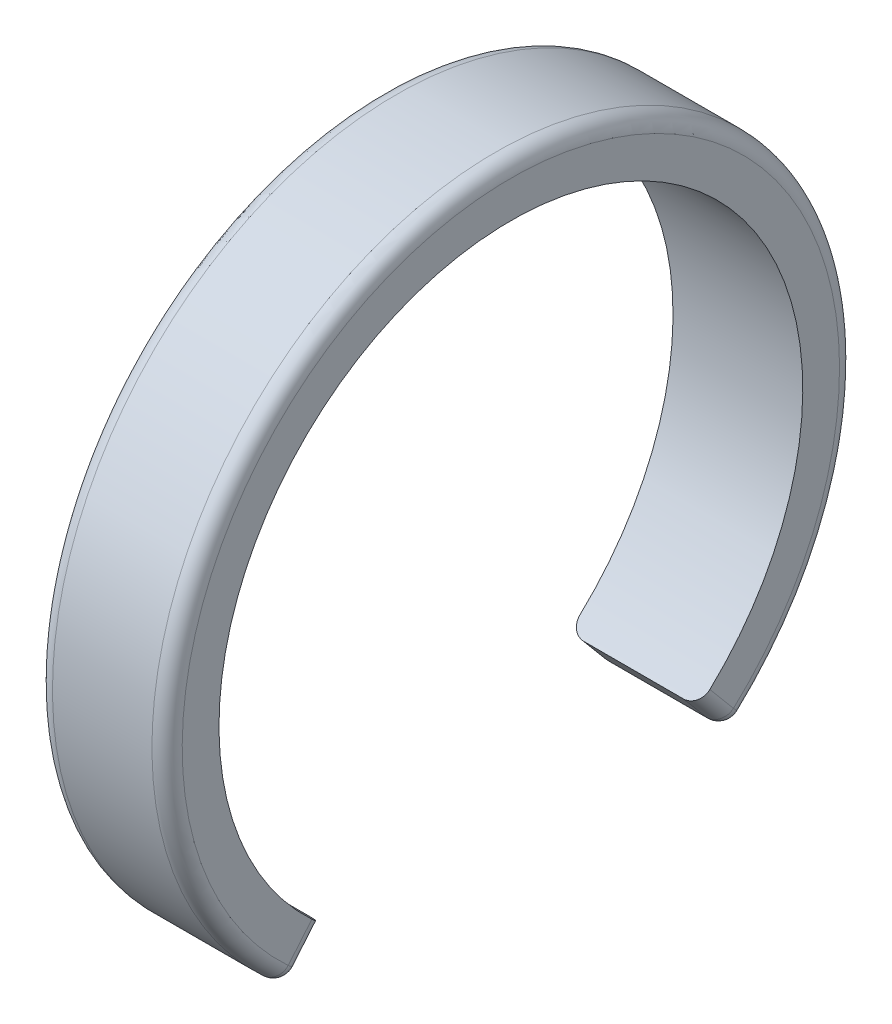
ISO-10303-21;
HEADER;
FILE_DESCRIPTION(('STEP AP214'),'2;1');
FILE_NAME('part.step','',(''),(''),'','','');
FILE_SCHEMA(('AUTOMOTIVE_DESIGN { 1 0 10303 214 1 1 1 1 }'));
ENDSEC;
DATA;
#1=APPLICATION_CONTEXT('core data for automotive mechanical design processes');
#2=APPLICATION_PROTOCOL_DEFINITION('international standard','automotive_design',2000,#1);
#3=PRODUCT_CONTEXT('',#1,'mechanical');
#4=PRODUCT('Part','Part','',(#3));
#5=PRODUCT_RELATED_PRODUCT_CATEGORY('part','',(#4));
#6=PRODUCT_DEFINITION_FORMATION('','',#4);
#7=PRODUCT_DEFINITION_CONTEXT('part definition',#1,'design');
#8=PRODUCT_DEFINITION('design','',#6,#7);
#9=PRODUCT_DEFINITION_SHAPE('','',#8);
#10=(LENGTH_UNIT() NAMED_UNIT(*) SI_UNIT(.MILLI.,.METRE.));
#11=(NAMED_UNIT(*) PLANE_ANGLE_UNIT() SI_UNIT($,.RADIAN.));
#12=(NAMED_UNIT(*) SI_UNIT($,.STERADIAN.) SOLID_ANGLE_UNIT());
#13=UNCERTAINTY_MEASURE_WITH_UNIT(LENGTH_MEASURE(1.E-05),#10,'distance_accuracy_value','');
#14=(GEOMETRIC_REPRESENTATION_CONTEXT(3) GLOBAL_UNCERTAINTY_ASSIGNED_CONTEXT((#13)) GLOBAL_UNIT_ASSIGNED_CONTEXT((#10,
#11,#12)) REPRESENTATION_CONTEXT('',''));
#15=CARTESIAN_POINT('',(0.,0.,0.));
#16=DIRECTION('',(0.,0.,1.));
#17=DIRECTION('',(1.,0.,0.));
#18=AXIS2_PLACEMENT_3D('',#15,#16,#17);
#19=CARTESIAN_POINT('',(2.3,0.,0.));
#20=DIRECTION('',(-1.,0.,0.));
#21=DIRECTION('',(0.,0.,1.));
#22=AXIS2_PLACEMENT_3D('',#19,#20,#21);
#23=TOROIDAL_SURFACE('',#22,15.2,0.699999999999999);
#24=CARTESIAN_POINT('',(2.3,0.,0.));
#25=DIRECTION('',(-1.,0.,0.));
#26=DIRECTION('',(0.,0.,1.));
#27=AXIS2_PLACEMENT_3D('',#24,#25,#26);
#28=CIRCLE('',#27,15.9);
#29=CARTESIAN_POINT('',(2.3,-11.6965109622396,10.770405345678));
#30=VERTEX_POINT('',#29);
#31=CARTESIAN_POINT('',(2.3,-11.6965109622396,-10.770405345678));
#32=VERTEX_POINT('',#31);
#33=EDGE_CURVE('E190',#30,#32,#28,.T.);
#34=ORIENTED_EDGE('',*,*,#33,.F.);
#35=CARTESIAN_POINT('',(2.3,-11.1815702280529,10.2962365568746));
#36=DIRECTION('',(0.,0.677383984004905,0.735629620266641));
#37=DIRECTION('',(0.,-0.735629620266641,0.677383984004905));
#38=AXIS2_PLACEMENT_3D('',#35,#36,#37);
#39=CIRCLE('',#38,0.699999999999999);
#40=CARTESIAN_POINT('',(3.,-11.1815702280529,10.2962365568746));
#41=VERTEX_POINT('',#40);
#42=EDGE_CURVE('E250',#30,#41,#39,.T.);
#43=ORIENTED_EDGE('',*,*,#42,.T.);
#44=CARTESIAN_POINT('',(3.,0.,0.));
#45=DIRECTION('',(-1.,0.,0.));
#46=DIRECTION('',(0.,0.,1.));
#47=AXIS2_PLACEMENT_3D('',#44,#45,#46);
#48=CIRCLE('',#47,15.2);
#49=CARTESIAN_POINT('',(3.,-11.1815702280529,-10.2962365568746));
#50=VERTEX_POINT('',#49);
#51=EDGE_CURVE('E135',#41,#50,#48,.T.);
#52=ORIENTED_EDGE('',*,*,#51,.T.);
#53=CARTESIAN_POINT('',(2.3,-11.1815702280529,-10.2962365568746));
#54=DIRECTION('',(0.,-0.677383984004905,0.735629620266641));
#55=DIRECTION('',(0.,-0.735629620266641,-0.677383984004905));
#56=AXIS2_PLACEMENT_3D('',#53,#54,#55);
#57=CIRCLE('',#56,0.699999999999999);
#58=EDGE_CURVE('E143',#50,#32,#57,.F.);
#59=ORIENTED_EDGE('',*,*,#58,.T.);
#60=EDGE_LOOP('',(#34,#43,#52,#59));
#61=FACE_BOUND('',#60,.T.);
#62=ADVANCED_FACE('F34',(#61),#23,.T.);
#63=CARTESIAN_POINT('',(-25.6726076388645,0.,0.));
#64=DIRECTION('',(-1.,0.,0.));
#65=DIRECTION('',(0.,0.,1.));
#66=AXIS2_PLACEMENT_3D('',#63,#64,#65);
#67=CYLINDRICAL_SURFACE('',#66,15.9);
#68=CARTESIAN_POINT('',(-2.3,0.,0.));
#69=DIRECTION('',(-1.,0.,0.));
#70=DIRECTION('',(0.,0.,1.));
#71=AXIS2_PLACEMENT_3D('',#68,#69,#70);
#72=CIRCLE('',#71,15.9);
#73=CARTESIAN_POINT('',(-2.3,-11.6965109622396,10.770405345678));
#74=VERTEX_POINT('',#73);
#75=CARTESIAN_POINT('',(-2.3,-11.6965109622396,-10.770405345678));
#76=VERTEX_POINT('',#75);
#77=EDGE_CURVE('E193',#74,#76,#72,.T.);
#78=ORIENTED_EDGE('',*,*,#77,.F.);
#79=DIRECTION('',(-1.,0.,0.));
#80=VECTOR('',#79,1.);
#81=CARTESIAN_POINT('',(-25.6726076388645,-11.6965109622396,10.770405345678));
#82=LINE('',#81,#80);
#83=EDGE_CURVE('E11',#74,#30,#82,.F.);
#84=ORIENTED_EDGE('',*,*,#83,.T.);
#85=ORIENTED_EDGE('',*,*,#33,.T.);
#86=DIRECTION('',(-1.,0.,0.));
#87=VECTOR('',#86,1.);
#88=CARTESIAN_POINT('',(-25.6726076388645,-11.6965109622396,-10.770405345678));
#89=LINE('',#88,#87);
#90=EDGE_CURVE('E44',#32,#76,#89,.T.);
#91=ORIENTED_EDGE('',*,*,#90,.T.);
#92=EDGE_LOOP('',(#78,#84,#85,#91));
#93=FACE_BOUND('',#92,.T.);
#94=ADVANCED_FACE('F260',(#93),#67,.T.);
#95=CARTESIAN_POINT('',(-2.3,0.,0.));
#96=DIRECTION('',(-1.,0.,0.));
#97=DIRECTION('',(0.,0.,1.));
#98=AXIS2_PLACEMENT_3D('',#95,#96,#97);
#99=TOROIDAL_SURFACE('',#98,15.2,0.699999999999999);
#100=CARTESIAN_POINT('',(-3.,0.,0.));
#101=DIRECTION('',(-1.,0.,0.));
#102=DIRECTION('',(0.,0.,1.));
#103=AXIS2_PLACEMENT_3D('',#100,#101,#102);
#104=CIRCLE('',#103,15.2);
#105=CARTESIAN_POINT('',(-3.,-11.1815702280529,10.2962365568746));
#106=VERTEX_POINT('',#105);
#107=CARTESIAN_POINT('',(-3.,-11.1815702280529,-10.2962365568746));
#108=VERTEX_POINT('',#107);
#109=EDGE_CURVE('E196',#106,#108,#104,.T.);
#110=ORIENTED_EDGE('',*,*,#109,.F.);
#111=CARTESIAN_POINT('',(-2.3,-11.1815702280529,10.2962365568746));
#112=DIRECTION('',(0.,0.677383984004905,0.735629620266641));
#113=DIRECTION('',(0.,-0.735629620266641,0.677383984004905));
#114=AXIS2_PLACEMENT_3D('',#111,#112,#113);
#115=CIRCLE('',#114,0.699999999999999);
#116=EDGE_CURVE('E243',#106,#74,#115,.T.);
#117=ORIENTED_EDGE('',*,*,#116,.T.);
#118=ORIENTED_EDGE('',*,*,#77,.T.);
#119=CARTESIAN_POINT('',(-2.3,-11.1815702280529,-10.2962365568746));
#120=DIRECTION('',(0.,-0.677383984004905,0.735629620266641));
#121=DIRECTION('',(0.,-0.735629620266641,-0.677383984004905));
#122=AXIS2_PLACEMENT_3D('',#119,#120,#121);
#123=CIRCLE('',#122,0.699999999999999);
#124=EDGE_CURVE('E245',#76,#108,#123,.F.);
#125=ORIENTED_EDGE('',*,*,#124,.T.);
#126=EDGE_LOOP('',(#110,#117,#118,#125));
#127=FACE_BOUND('',#126,.T.);
#128=ADVANCED_FACE('F275',(#127),#99,.T.);
#129=CARTESIAN_POINT('',(-3.,-11.6438755354085,9.77037166723534));
#130=DIRECTION('',(1.,0.,0.));
#131=DIRECTION('',(0.,0.,-1.));
#132=AXIS2_PLACEMENT_3D('',#129,#130,#131);
#133=PLANE('',#132);
#134=CARTESIAN_POINT('',(-3.,0.,0.));
#135=DIRECTION('',(-1.,0.,0.));
#136=DIRECTION('',(0.,0.,1.));
#137=AXIS2_PLACEMENT_3D('',#134,#135,#136);
#138=CIRCLE('',#137,13.5);
#139=CARTESIAN_POINT('',(-3.,-9.87773701022745,9.20219058468052));
#140=VERTEX_POINT('',#139);
#141=CARTESIAN_POINT('',(-3.,-9.87773701022745,-9.20219058468052));
#142=VERTEX_POINT('',#141);
#143=EDGE_CURVE('E199',#140,#142,#138,.T.);
#144=ORIENTED_EDGE('',*,*,#143,.F.);
#145=DIRECTION('',(0.,0.766044443118982,-0.642787609686535));
#146=VECTOR('',#145,1.);
#147=CARTESIAN_POINT('',(-3.,-11.193924208628,10.3066027774186));
#148=LINE('',#147,#146);
#149=EDGE_CURVE('E140',#140,#106,#148,.F.);
#150=ORIENTED_EDGE('',*,*,#149,.T.);
#151=ORIENTED_EDGE('',*,*,#109,.T.);
#152=DIRECTION('',(0.,0.766044443118982,0.642787609686535));
#153=VECTOR('',#152,1.);
#154=CARTESIAN_POINT('',(-3.,-1.5719864409238,-2.23283834532742));
#155=LINE('',#154,#153);
#156=EDGE_CURVE('E248',#108,#142,#155,.T.);
#157=ORIENTED_EDGE('',*,*,#156,.T.);
#158=EDGE_LOOP('',(#144,#150,#151,#157));
#159=FACE_BOUND('',#158,.T.);
#160=ADVANCED_FACE('F172',(#159),#133,.F.);
#161=CARTESIAN_POINT('',(-25.6726076388645,0.,0.));
#162=DIRECTION('',(-1.,0.,0.));
#163=DIRECTION('',(0.,0.,1.));
#164=AXIS2_PLACEMENT_3D('',#161,#162,#163);
#165=CYLINDRICAL_SURFACE('',#164,13.5);
#166=CARTESIAN_POINT('',(3.,0.,0.));
#167=DIRECTION('',(-1.,0.,0.));
#168=DIRECTION('',(0.,0.,1.));
#169=AXIS2_PLACEMENT_3D('',#166,#167,#168);
#170=CIRCLE('',#169,13.5);
#171=CARTESIAN_POINT('',(3.,-9.87773701022745,9.20219058468052));
#172=VERTEX_POINT('',#171);
#173=CARTESIAN_POINT('',(3.,-9.87773701022745,-9.20219058468052));
#174=VERTEX_POINT('',#173);
#175=EDGE_CURVE('E201',#172,#174,#170,.T.);
#176=ORIENTED_EDGE('',*,*,#175,.F.);
#177=CARTESIAN_POINT('',(3.,-9.87773701022745,9.20219058468052));
#178=CARTESIAN_POINT('',(3.00003379249907,-9.90458187068196,9.17338474171216));
#179=CARTESIAN_POINT('',(2.99668860775192,-9.93128506651023,9.14445903380075));
#180=CARTESIAN_POINT('',(2.98347925035672,-9.98367773555522,9.08722373747809));
#181=CARTESIAN_POINT('',(2.97362005757721,-10.0093679672831,9.05891369546248));
#182=CARTESIAN_POINT('',(2.94761418375645,-10.0590604752255,9.00370460485947));
#183=CARTESIAN_POINT('',(2.93146421613048,-10.0830618613595,8.97680630217758));
#184=CARTESIAN_POINT('',(2.89334636533364,-10.1287250175593,8.92525143349386));
#185=CARTESIAN_POINT('',(2.87137958686896,-10.1503872307731,8.90059444302384));
#186=CARTESIAN_POINT('',(2.8222645724846,-10.1908061537231,8.85428803169328));
#187=CARTESIAN_POINT('',(2.79512004733241,-10.20956492695,8.83263647599337));
#188=CARTESIAN_POINT('',(2.7364027654069,-10.2437326100723,8.79298748070518));
#189=CARTESIAN_POINT('',(2.70482912012069,-10.2591408462407,8.77499077608342));
#190=CARTESIAN_POINT('',(2.63814112044795,-10.2862355534724,8.74321428596424));
#191=CARTESIAN_POINT('',(2.60302499695652,-10.2979201527253,8.72943662144362));
#192=CARTESIAN_POINT('',(2.53026598260731,-10.3172755182503,8.70655223699819));
#193=CARTESIAN_POINT('',(2.492624569394,-10.3249486090921,8.69744281200495));
#194=CARTESIAN_POINT('',(2.42896364269989,-10.3342101738647,8.68643383151779));
#195=CARTESIAN_POINT('',(2.40334281766334,-10.3369803329172,8.6831360581581));
#196=CARTESIAN_POINT('',(2.35181822918774,-10.3406746856015,8.67873547079303));
#197=CARTESIAN_POINT('',(2.32591491542383,-10.3416014754775,8.67762956971133));
#198=CARTESIAN_POINT('',(2.3,-10.3415999821063,8.67763273076822));
#199=B_SPLINE_CURVE_WITH_KNOTS('',3,(#177,#178,#179,#180,#181,#182,#183,#184,#185,#186,#187,
#188,#189,#190,#191,#192,#193,#194,#195,#196,#197,#198),.UNSPECIFIED.,.F.,.F.,(4,2,2,2,2,2,2,2,
2,2,4),(0.,0.117971243149975,0.235852403117764,0.353795232305591,0.471715678293009,
0.589551928894713,0.70741185217877,0.825330928569967,0.943181597828514,1.02097327177747,
1.09865530431405),.UNSPECIFIED.);
#200=CARTESIAN_POINT('',(2.3,-10.3415999821063,8.67763273076822));
#201=VERTEX_POINT('',#200);
#202=EDGE_CURVE('E134',#172,#201,#199,.T.);
#203=ORIENTED_EDGE('',*,*,#202,.T.);
#204=DIRECTION('',(1.,0.,0.));
#205=VECTOR('',#204,1.);
#206=CARTESIAN_POINT('',(3.,-10.3415999821063,8.67763273076822));
#207=LINE('',#206,#205);
#208=CARTESIAN_POINT('',(-2.3,-10.3415999821063,8.67763273076822));
#209=VERTEX_POINT('',#208);
#210=EDGE_CURVE('E117',#209,#201,#207,.T.);
#211=ORIENTED_EDGE('',*,*,#210,.F.);
#212=CARTESIAN_POINT('',(-2.3,-10.3415999821063,8.67763273076822));
#213=CARTESIAN_POINT('',(-2.33937975468516,-10.3416177210108,8.67760395511709));
#214=CARTESIAN_POINT('',(-2.37874952831749,-10.3394651779727,8.68017676368015));
#215=CARTESIAN_POINT('',(-2.45634551979054,-10.3309503572609,8.6903131990754));
#216=CARTESIAN_POINT('',(-2.49457260498033,-10.3245913618741,8.69787293460513));
#217=CARTESIAN_POINT('',(-2.56884230565515,-10.3077900463509,8.71777627566304));
#218=CARTESIAN_POINT('',(-2.60488385960084,-10.2973457599994,8.73012218470949));
#219=CARTESIAN_POINT('',(-2.67373461943515,-10.2726283317097,8.75919357936855));
#220=CARTESIAN_POINT('',(-2.70654439200667,-10.2583558626713,8.77591829528279));
#221=CARTESIAN_POINT('',(-2.76800277891042,-10.2263256814601,8.81322102522237));
#222=CARTESIAN_POINT('',(-2.79665190144775,-10.2085683955663,8.83379856793779));
#223=CARTESIAN_POINT('',(-2.84898530320771,-10.1700019379422,8.87817114640339));
#224=CARTESIAN_POINT('',(-2.87266866653229,-10.149192204411,8.90196677437686));
#225=CARTESIAN_POINT('',(-2.91438522093961,-10.1050616780125,8.95202996772625));
#226=CARTESIAN_POINT('',(-2.93241999241436,-10.081741589963,8.97829683900568));
#227=CARTESIAN_POINT('',(-2.96233286977572,-10.0331984301934,9.03251069407842));
#228=CARTESIAN_POINT('',(-2.97421446677361,-10.0079764468739,9.06045671510918));
#229=CARTESIAN_POINT('',(-2.98855519575614,-9.96513065069785,9.10751405385348));
#230=CARTESIAN_POINT('',(-2.99284502863344,-9.94784323435446,9.12639423210738));
#231=CARTESIAN_POINT('',(-2.99856708413855,-9.91297050711033,9.16426123753904));
#232=CARTESIAN_POINT('',(-3.00000338852921,-9.89538565805677,9.18324787336627));
#233=CARTESIAN_POINT('',(-3.,-9.87773701022745,9.20219058468052));
#234=B_SPLINE_CURVE_WITH_KNOTS('',3,(#212,#213,#214,#215,#216,#217,#218,#219,#220,#221,#222,
#223,#224,#225,#226,#227,#228,#229,#230,#231,#232,#233),.UNSPECIFIED.,.F.,.F.,(4,2,2,2,2,2,2,2,
2,2,4),(0.,0.117982348424925,0.23587274386842,0.353819948889393,0.471746435277011,
0.589658505326414,0.707592304303087,0.825493077620019,0.94332688437979,1.02104651795747,
1.09865489903491),.UNSPECIFIED.);
#235=EDGE_CURVE('E131',#209,#140,#234,.T.);
#236=ORIENTED_EDGE('',*,*,#235,.T.);
#237=ORIENTED_EDGE('',*,*,#143,.T.);
#238=CARTESIAN_POINT('',(-3.,-9.87773701022745,-9.20219058468052));
#239=CARTESIAN_POINT('',(-3.00003379249907,-9.90458187068196,-9.17338474171216));
#240=CARTESIAN_POINT('',(-2.99668860775192,-9.93128506651023,-9.14445903380075));
#241=CARTESIAN_POINT('',(-2.98347925035672,-9.98367773555522,-9.08722373747809));
#242=CARTESIAN_POINT('',(-2.97362005757721,-10.0093679672831,-9.05891369546248));
#243=CARTESIAN_POINT('',(-2.94761418375645,-10.0590604752255,-9.00370460485947));
#244=CARTESIAN_POINT('',(-2.93146421613048,-10.0830618613595,-8.97680630217758));
#245=CARTESIAN_POINT('',(-2.89334636533364,-10.1287250175592,-8.92525143349386));
#246=CARTESIAN_POINT('',(-2.87137958686896,-10.1503872307731,-8.90059444302384));
#247=CARTESIAN_POINT('',(-2.8222645724846,-10.1908061537231,-8.85428803169329));
#248=CARTESIAN_POINT('',(-2.79512004733241,-10.20956492695,-8.83263647599337));
#249=CARTESIAN_POINT('',(-2.7364027654069,-10.2437326100723,-8.79298748070518));
#250=CARTESIAN_POINT('',(-2.70482912012069,-10.2591408462407,-8.77499077608342));
#251=CARTESIAN_POINT('',(-2.63814112044795,-10.2862355534724,-8.74321428596424));
#252=CARTESIAN_POINT('',(-2.60302499695651,-10.2979201527253,-8.72943662144363));
#253=CARTESIAN_POINT('',(-2.53026598260731,-10.3172755182503,-8.70655223699819));
#254=CARTESIAN_POINT('',(-2.492624569394,-10.3249486090921,-8.69744281200495));
#255=CARTESIAN_POINT('',(-2.42896364269989,-10.3342101738647,-8.68643383151779));
#256=CARTESIAN_POINT('',(-2.40334281766334,-10.3369803329172,-8.6831360581581));
#257=CARTESIAN_POINT('',(-2.35181822918773,-10.3406746856015,-8.67873547079303));
#258=CARTESIAN_POINT('',(-2.32591491542383,-10.3416014754775,-8.67762956971133));
#259=CARTESIAN_POINT('',(-2.3,-10.3415999821063,-8.67763273076823));
#260=B_SPLINE_CURVE_WITH_KNOTS('',3,(#238,#239,#240,#241,#242,#243,#244,#245,#246,#247,#248,
#249,#250,#251,#252,#253,#254,#255,#256,#257,#258,#259),.UNSPECIFIED.,.F.,.F.,(4,2,2,2,2,2,2,2,
2,2,4),(0.,0.117971243149974,0.235852403117764,0.353795232305591,0.471715678293009,
0.589551928894713,0.70741185217877,0.825330928569967,0.943181597828514,1.02097327177747,
1.09865530431405),.UNSPECIFIED.);
#261=CARTESIAN_POINT('',(-2.3,-10.3415999821063,-8.67763273076822));
#262=VERTEX_POINT('',#261);
#263=EDGE_CURVE('E145',#142,#262,#260,.T.);
#264=ORIENTED_EDGE('',*,*,#263,.T.);
#265=DIRECTION('',(1.,0.,0.));
#266=VECTOR('',#265,1.);
#267=CARTESIAN_POINT('',(3.,-10.3415999821063,-8.67763273076822));
#268=LINE('',#267,#266);
#269=CARTESIAN_POINT('',(2.3,-10.3415999821063,-8.67763273076822));
#270=VERTEX_POINT('',#269);
#271=EDGE_CURVE('E136',#262,#270,#268,.T.);
#272=ORIENTED_EDGE('',*,*,#271,.T.);
#273=CARTESIAN_POINT('',(2.3,-10.3415999821063,-8.67763273076822));
#274=CARTESIAN_POINT('',(2.33937975468516,-10.3416177210108,-8.67760395511709));
#275=CARTESIAN_POINT('',(2.37874952831749,-10.3394651779727,-8.68017676368015));
#276=CARTESIAN_POINT('',(2.45634551979054,-10.3309503572609,-8.6903131990754));
#277=CARTESIAN_POINT('',(2.49457260498033,-10.3245913618741,-8.69787293460514));
#278=CARTESIAN_POINT('',(2.56884230565515,-10.3077900463508,-8.71777627566304));
#279=CARTESIAN_POINT('',(2.60488385960084,-10.2973457599994,-8.73012218470949));
#280=CARTESIAN_POINT('',(2.67373461943515,-10.2726283317096,-8.75919357936855));
#281=CARTESIAN_POINT('',(2.70654439200668,-10.2583558626713,-8.77591829528279));
#282=CARTESIAN_POINT('',(2.76800277891043,-10.2263256814601,-8.81322102522237));
#283=CARTESIAN_POINT('',(2.79665190144775,-10.2085683955663,-8.83379856793779));
#284=CARTESIAN_POINT('',(2.84898530320772,-10.1700019379422,-8.87817114640339));
#285=CARTESIAN_POINT('',(2.87266866653229,-10.149192204411,-8.90196677437686));
#286=CARTESIAN_POINT('',(2.91438522093961,-10.1050616780125,-8.95202996772625));
#287=CARTESIAN_POINT('',(2.93241999241436,-10.081741589963,-8.97829683900569));
#288=CARTESIAN_POINT('',(2.96233286977572,-10.0331984301934,-9.03251069407842));
#289=CARTESIAN_POINT('',(2.97421446677361,-10.0079764468739,-9.06045671510918));
#290=CARTESIAN_POINT('',(2.98855519575614,-9.96513065069785,-9.10751405385349));
#291=CARTESIAN_POINT('',(2.99284502863345,-9.94784323435446,-9.12639423210738));
#292=CARTESIAN_POINT('',(2.99856708413855,-9.91297050711032,-9.16426123753904));
#293=CARTESIAN_POINT('',(3.00000338852921,-9.89538565805677,-9.18324787336628));
#294=CARTESIAN_POINT('',(3.,-9.87773701022745,-9.20219058468052));
#295=B_SPLINE_CURVE_WITH_KNOTS('',3,(#273,#274,#275,#276,#277,#278,#279,#280,#281,#282,#283,
#284,#285,#286,#287,#288,#289,#290,#291,#292,#293,#294),.UNSPECIFIED.,.F.,.F.,(4,2,2,2,2,2,2,2,
2,2,4),(0.,0.117982348424925,0.23587274386842,0.353819948889392,0.471746435277012,
0.589658505326414,0.707592304303087,0.825493077620021,0.943326884379791,1.02104651795747,
1.09865489903491),.UNSPECIFIED.);
#296=EDGE_CURVE('E141',#270,#174,#295,.T.);
#297=ORIENTED_EDGE('',*,*,#296,.T.);
#298=EDGE_LOOP('',(#176,#203,#211,#236,#237,#264,#272,#297));
#299=FACE_BOUND('',#298,.T.);
#300=ADVANCED_FACE('F129',(#299),#165,.F.);
#301=CARTESIAN_POINT('',(3.,-11.6438755354085,9.77037166723534));
#302=DIRECTION('',(-1.,0.,0.));
#303=DIRECTION('',(0.,0.,1.));
#304=AXIS2_PLACEMENT_3D('',#301,#302,#303);
#305=PLANE('',#304);
#306=ORIENTED_EDGE('',*,*,#51,.F.);
#307=DIRECTION('',(0.,-0.766044443118982,0.642787609686535));
#308=VECTOR('',#307,1.);
#309=CARTESIAN_POINT('',(3.,-9.89164865532568,9.21386384095151));
#310=LINE('',#309,#308);
#311=EDGE_CURVE('E183',#41,#172,#310,.F.);
#312=ORIENTED_EDGE('',*,*,#311,.T.);
#313=ORIENTED_EDGE('',*,*,#175,.T.);
#314=DIRECTION('',(0.,-0.766044443118982,-0.642787609686535));
#315=VECTOR('',#314,1.);
#316=CARTESIAN_POINT('',(3.,-1.5719864409238,-2.23283834532742));
#317=LINE('',#316,#315);
#318=EDGE_CURVE('E185',#174,#50,#317,.T.);
#319=ORIENTED_EDGE('',*,*,#318,.T.);
#320=EDGE_LOOP('',(#306,#312,#313,#319));
#321=FACE_BOUND('',#320,.T.);
#322=ADVANCED_FACE('F171',(#321),#305,.F.);
#323=CARTESIAN_POINT('',(2.3,-11.6438755354085,9.77037166723534));
#324=DIRECTION('',(0.,-0.642787609686535,-0.766044443118982));
#325=DIRECTION('',(1.,0.,0.));
#326=AXIS2_PLACEMENT_3D('',#323,#324,#325);
#327=PLANE('',#326);
#328=ORIENTED_EDGE('',*,*,#210,.T.);
#329=DIRECTION('',(0.,-0.766044443118982,0.642787609686535));
#330=VECTOR('',#329,1.);
#331=CARTESIAN_POINT('',(2.3,-11.6438755354085,9.77037166723534));
#332=LINE('',#331,#330);
#333=CARTESIAN_POINT('',(2.3,-11.6315215548335,9.76000544669128));
#334=VERTEX_POINT('',#333);
#335=EDGE_CURVE('E125',#201,#334,#332,.T.);
#336=ORIENTED_EDGE('',*,*,#335,.T.);
#337=DIRECTION('',(1.,0.,0.));
#338=VECTOR('',#337,1.);
#339=CARTESIAN_POINT('',(-2.3,-11.6315215548335,9.76000544669128));
#340=LINE('',#339,#338);
#341=CARTESIAN_POINT('',(-2.3,-11.6315215548335,9.76000544669128));
#342=VERTEX_POINT('',#341);
#343=EDGE_CURVE('E120',#334,#342,#340,.F.);
#344=ORIENTED_EDGE('',*,*,#343,.T.);
#345=DIRECTION('',(0.,0.766044443118982,-0.642787609686535));
#346=VECTOR('',#345,1.);
#347=CARTESIAN_POINT('',(-2.3,-10.3415999821063,8.67763273076822));
#348=LINE('',#347,#346);
#349=EDGE_CURVE('E113',#342,#209,#348,.T.);
#350=ORIENTED_EDGE('',*,*,#349,.T.);
#351=EDGE_LOOP('',(#328,#336,#344,#350));
#352=FACE_BOUND('',#351,.T.);
#353=ADVANCED_FACE('F115',(#352),#327,.T.);
#354=CARTESIAN_POINT('',(2.3,-11.6438755354085,-9.77037166723534));
#355=DIRECTION('',(0.,0.642787609686535,-0.766044443118982));
#356=DIRECTION('',(1.,0.,0.));
#357=AXIS2_PLACEMENT_3D('',#354,#355,#356);
#358=PLANE('',#357);
#359=DIRECTION('',(-1.,0.,0.));
#360=VECTOR('',#359,1.);
#361=CARTESIAN_POINT('',(2.3,-11.6315215548335,-9.76000544669128));
#362=LINE('',#361,#360);
#363=CARTESIAN_POINT('',(-2.3,-11.6315215548335,-9.76000544669128));
#364=VERTEX_POINT('',#363);
#365=CARTESIAN_POINT('',(2.3,-11.6315215548335,-9.76000544669128));
#366=VERTEX_POINT('',#365);
#367=EDGE_CURVE('E52',#364,#366,#362,.F.);
#368=ORIENTED_EDGE('',*,*,#367,.T.);
#369=DIRECTION('',(0.,-0.766044443118982,-0.642787609686535));
#370=VECTOR('',#369,1.);
#371=CARTESIAN_POINT('',(2.3,-11.6438755354085,-9.77037166723534));
#372=LINE('',#371,#370);
#373=EDGE_CURVE('E239',#366,#270,#372,.F.);
#374=ORIENTED_EDGE('',*,*,#373,.T.);
#375=ORIENTED_EDGE('',*,*,#271,.F.);
#376=DIRECTION('',(0.,0.766044443118982,0.642787609686535));
#377=VECTOR('',#376,1.);
#378=CARTESIAN_POINT('',(-2.3,-11.6438755354085,-9.77037166723534));
#379=LINE('',#378,#377);
#380=EDGE_CURVE('E57',#262,#364,#379,.F.);
#381=ORIENTED_EDGE('',*,*,#380,.T.);
#382=EDGE_LOOP('',(#368,#374,#375,#381));
#383=FACE_BOUND('',#382,.T.);
#384=ADVANCED_FACE('F268',(#383),#358,.F.);
#385=CARTESIAN_POINT('',(-2.3,-11.193924208628,10.3066027774186));
#386=DIRECTION('',(0.,-0.766044443118982,0.642787609686535));
#387=DIRECTION('',(0.,-0.642787609686535,-0.766044443118982));
#388=AXIS2_PLACEMENT_3D('',#385,#386,#387);
#389=CYLINDRICAL_SURFACE('',#388,0.7);
#390=CARTESIAN_POINT('',(-2.3,-11.1815702280529,10.2962365568746));
#391=DIRECTION('',(0.,-0.766044443118982,0.642787609686534));
#392=DIRECTION('',(0.,-0.642787609686534,-0.766044443118982));
#393=AXIS2_PLACEMENT_3D('',#390,#391,#392);
#394=CIRCLE('',#393,0.7);
#395=EDGE_CURVE('E207',#106,#342,#394,.T.);
#396=ORIENTED_EDGE('',*,*,#395,.F.);
#397=ORIENTED_EDGE('',*,*,#149,.F.);
#398=ORIENTED_EDGE('',*,*,#235,.F.);
#399=ORIENTED_EDGE('',*,*,#349,.F.);
#400=EDGE_LOOP('',(#396,#397,#398,#399));
#401=FACE_BOUND('',#400,.T.);
#402=ADVANCED_FACE('F139',(#401),#389,.T.);
#403=CARTESIAN_POINT('',(-2.3,-11.1815702280529,10.2962365568746));
#404=DIRECTION('',(0.,-0.642787609686535,-0.766044443118982));
#405=DIRECTION('',(0.,0.766044443118982,-0.642787609686535));
#406=AXIS2_PLACEMENT_3D('',#403,#404,#405);
#407=SPHERICAL_SURFACE('',#406,0.7);
#408=ORIENTED_EDGE('',*,*,#116,.F.);
#409=ORIENTED_EDGE('',*,*,#395,.T.);
#410=CARTESIAN_POINT('',(-2.3,-11.1815702280529,10.2962365568746));
#411=DIRECTION('',(1.,0.,0.));
#412=DIRECTION('',(0.,1.,0.));
#413=AXIS2_PLACEMENT_3D('',#410,#411,#412);
#414=CIRCLE('',#413,0.7);
#415=EDGE_CURVE('E209',#74,#342,#414,.T.);
#416=ORIENTED_EDGE('',*,*,#415,.F.);
#417=EDGE_LOOP('',(#408,#409,#416));
#418=FACE_BOUND('',#417,.T.);
#419=ADVANCED_FACE('F293',(#418),#407,.T.);
#420=CARTESIAN_POINT('',(-25.6726076388645,-11.1815702280529,10.2962365568746));
#421=DIRECTION('',(-1.,0.,0.));
#422=DIRECTION('',(0.,0.,1.));
#423=AXIS2_PLACEMENT_3D('',#420,#421,#422);
#424=CYLINDRICAL_SURFACE('',#423,0.7);
#425=CARTESIAN_POINT('',(2.3,-11.1815702280529,10.2962365568746));
#426=DIRECTION('',(1.,0.,0.));
#427=DIRECTION('',(0.,0.,-1.));
#428=AXIS2_PLACEMENT_3D('',#425,#426,#427);
#429=CIRCLE('',#428,0.7);
#430=EDGE_CURVE('E215',#30,#334,#429,.T.);
#431=ORIENTED_EDGE('',*,*,#430,.F.);
#432=ORIENTED_EDGE('',*,*,#83,.F.);
#433=ORIENTED_EDGE('',*,*,#415,.T.);
#434=ORIENTED_EDGE('',*,*,#343,.F.);
#435=EDGE_LOOP('',(#431,#432,#433,#434));
#436=FACE_BOUND('',#435,.T.);
#437=ADVANCED_FACE('F297',(#436),#424,.T.);
#438=CARTESIAN_POINT('',(2.3,-11.1815702280529,10.2962365568746));
#439=DIRECTION('',(0.,-0.642787609686535,-0.766044443118982));
#440=DIRECTION('',(0.,0.766044443118982,-0.642787609686535));
#441=AXIS2_PLACEMENT_3D('',#438,#439,#440);
#442=SPHERICAL_SURFACE('',#441,0.7);
#443=ORIENTED_EDGE('',*,*,#42,.F.);
#444=ORIENTED_EDGE('',*,*,#430,.T.);
#445=CARTESIAN_POINT('',(2.3,-11.1815702280529,10.2962365568746));
#446=DIRECTION('',(0.,0.766044443118981,-0.642787609686535));
#447=DIRECTION('',(0.,0.642787609686535,0.766044443118981));
#448=AXIS2_PLACEMENT_3D('',#445,#446,#447);
#449=CIRCLE('',#448,0.7);
#450=EDGE_CURVE('E229',#41,#334,#449,.T.);
#451=ORIENTED_EDGE('',*,*,#450,.F.);
#452=EDGE_LOOP('',(#443,#444,#451));
#453=FACE_BOUND('',#452,.T.);
#454=ADVANCED_FACE('F301',(#453),#442,.T.);
#455=CARTESIAN_POINT('',(2.3,-11.193924208628,10.3066027774186));
#456=DIRECTION('',(0.,0.766044443118982,-0.642787609686535));
#457=DIRECTION('',(0.,0.642787609686535,0.766044443118982));
#458=AXIS2_PLACEMENT_3D('',#455,#456,#457);
#459=CYLINDRICAL_SURFACE('',#458,0.7);
#460=ORIENTED_EDGE('',*,*,#202,.F.);
#461=ORIENTED_EDGE('',*,*,#311,.F.);
#462=ORIENTED_EDGE('',*,*,#450,.T.);
#463=ORIENTED_EDGE('',*,*,#335,.F.);
#464=EDGE_LOOP('',(#460,#461,#462,#463));
#465=FACE_BOUND('',#464,.T.);
#466=ADVANCED_FACE('F306',(#465),#459,.T.);
#467=CARTESIAN_POINT('',(-2.3,-1.5719864409238,-2.23283834532742));
#468=DIRECTION('',(0.,0.766044443118982,0.642787609686535));
#469=DIRECTION('',(0.,-0.642787609686535,0.766044443118982));
#470=AXIS2_PLACEMENT_3D('',#467,#468,#469);
#471=CYLINDRICAL_SURFACE('',#470,0.7);
#472=ORIENTED_EDGE('',*,*,#263,.F.);
#473=ORIENTED_EDGE('',*,*,#156,.F.);
#474=CARTESIAN_POINT('',(-2.3,-11.1815702280529,-10.2962365568746));
#475=DIRECTION('',(0.,-0.766044443118981,-0.642787609686535));
#476=DIRECTION('',(0.,0.642787609686535,-0.766044443118981));
#477=AXIS2_PLACEMENT_3D('',#474,#475,#476);
#478=CIRCLE('',#477,0.7);
#479=EDGE_CURVE('E39',#364,#108,#478,.T.);
#480=ORIENTED_EDGE('',*,*,#479,.F.);
#481=ORIENTED_EDGE('',*,*,#380,.F.);
#482=EDGE_LOOP('',(#472,#473,#480,#481));
#483=FACE_BOUND('',#482,.T.);
#484=ADVANCED_FACE('F36',(#483),#471,.T.);
#485=CARTESIAN_POINT('',(-2.3,-11.1815702280529,-10.2962365568746));
#486=DIRECTION('',(0.,0.642787609686535,-0.766044443118982));
#487=DIRECTION('',(0.,0.766044443118982,0.642787609686535));
#488=AXIS2_PLACEMENT_3D('',#485,#486,#487);
#489=SPHERICAL_SURFACE('',#488,0.7);
#490=ORIENTED_EDGE('',*,*,#479,.T.);
#491=ORIENTED_EDGE('',*,*,#124,.F.);
#492=CARTESIAN_POINT('',(-2.3,-11.1815702280529,-10.2962365568746));
#493=DIRECTION('',(1.,0.,0.));
#494=DIRECTION('',(0.,1.,0.));
#495=AXIS2_PLACEMENT_3D('',#492,#493,#494);
#496=CIRCLE('',#495,0.7);
#497=EDGE_CURVE('E223',#364,#76,#496,.T.);
#498=ORIENTED_EDGE('',*,*,#497,.F.);
#499=EDGE_LOOP('',(#490,#491,#498));
#500=FACE_BOUND('',#499,.T.);
#501=ADVANCED_FACE('F272',(#500),#489,.T.);
#502=CARTESIAN_POINT('',(-25.6726076388645,-11.1815702280529,-10.2962365568746));
#503=DIRECTION('',(-1.,0.,0.));
#504=DIRECTION('',(0.,0.,1.));
#505=AXIS2_PLACEMENT_3D('',#502,#503,#504);
#506=CYLINDRICAL_SURFACE('',#505,0.7);
#507=ORIENTED_EDGE('',*,*,#497,.T.);
#508=ORIENTED_EDGE('',*,*,#90,.F.);
#509=CARTESIAN_POINT('',(2.3,-11.1815702280529,-10.2962365568746));
#510=DIRECTION('',(1.,0.,0.));
#511=DIRECTION('',(0.,1.,0.));
#512=AXIS2_PLACEMENT_3D('',#509,#510,#511);
#513=CIRCLE('',#512,0.7);
#514=EDGE_CURVE('E221',#366,#32,#513,.T.);
#515=ORIENTED_EDGE('',*,*,#514,.F.);
#516=ORIENTED_EDGE('',*,*,#367,.F.);
#517=EDGE_LOOP('',(#507,#508,#515,#516));
#518=FACE_BOUND('',#517,.T.);
#519=ADVANCED_FACE('F262',(#518),#506,.T.);
#520=CARTESIAN_POINT('',(2.3,-11.1815702280529,-10.2962365568746));
#521=DIRECTION('',(0.,0.642787609686535,-0.766044443118982));
#522=DIRECTION('',(0.,0.766044443118982,0.642787609686535));
#523=AXIS2_PLACEMENT_3D('',#520,#521,#522);
#524=SPHERICAL_SURFACE('',#523,0.7);
#525=ORIENTED_EDGE('',*,*,#514,.T.);
#526=ORIENTED_EDGE('',*,*,#58,.F.);
#527=CARTESIAN_POINT('',(2.3,-11.1815702280529,-10.2962365568746));
#528=DIRECTION('',(0.,0.766044443118981,0.642787609686535));
#529=DIRECTION('',(0.,-0.642787609686535,0.766044443118981));
#530=AXIS2_PLACEMENT_3D('',#527,#528,#529);
#531=CIRCLE('',#530,0.7);
#532=EDGE_CURVE('E219',#366,#50,#531,.T.);
#533=ORIENTED_EDGE('',*,*,#532,.F.);
#534=EDGE_LOOP('',(#525,#526,#533));
#535=FACE_BOUND('',#534,.T.);
#536=ADVANCED_FACE('F264',(#535),#524,.T.);
#537=CARTESIAN_POINT('',(2.3,-1.5719864409238,-2.23283834532742));
#538=DIRECTION('',(0.,-0.766044443118982,-0.642787609686535));
#539=DIRECTION('',(0.,0.642787609686535,-0.766044443118982));
#540=AXIS2_PLACEMENT_3D('',#537,#538,#539);
#541=CYLINDRICAL_SURFACE('',#540,0.7);
#542=ORIENTED_EDGE('',*,*,#296,.F.);
#543=ORIENTED_EDGE('',*,*,#373,.F.);
#544=ORIENTED_EDGE('',*,*,#532,.T.);
#545=ORIENTED_EDGE('',*,*,#318,.F.);
#546=EDGE_LOOP('',(#542,#543,#544,#545));
#547=FACE_BOUND('',#546,.T.);
#548=ADVANCED_FACE('F267',(#547),#541,.T.);
#549=CLOSED_SHELL('',(#62,#94,#128,#160,#300,#322,#353,#384,#402,#419,#437,#454,#466,#484,#501,
#519,#536,#548));
#550=MANIFOLD_SOLID_BREP('B2',#549);
#551=ADVANCED_BREP_SHAPE_REPRESENTATION('',(#18,#550),#14);
#552=SHAPE_DEFINITION_REPRESENTATION(#9,#551);
ENDSEC;
END-ISO-10303-21;
